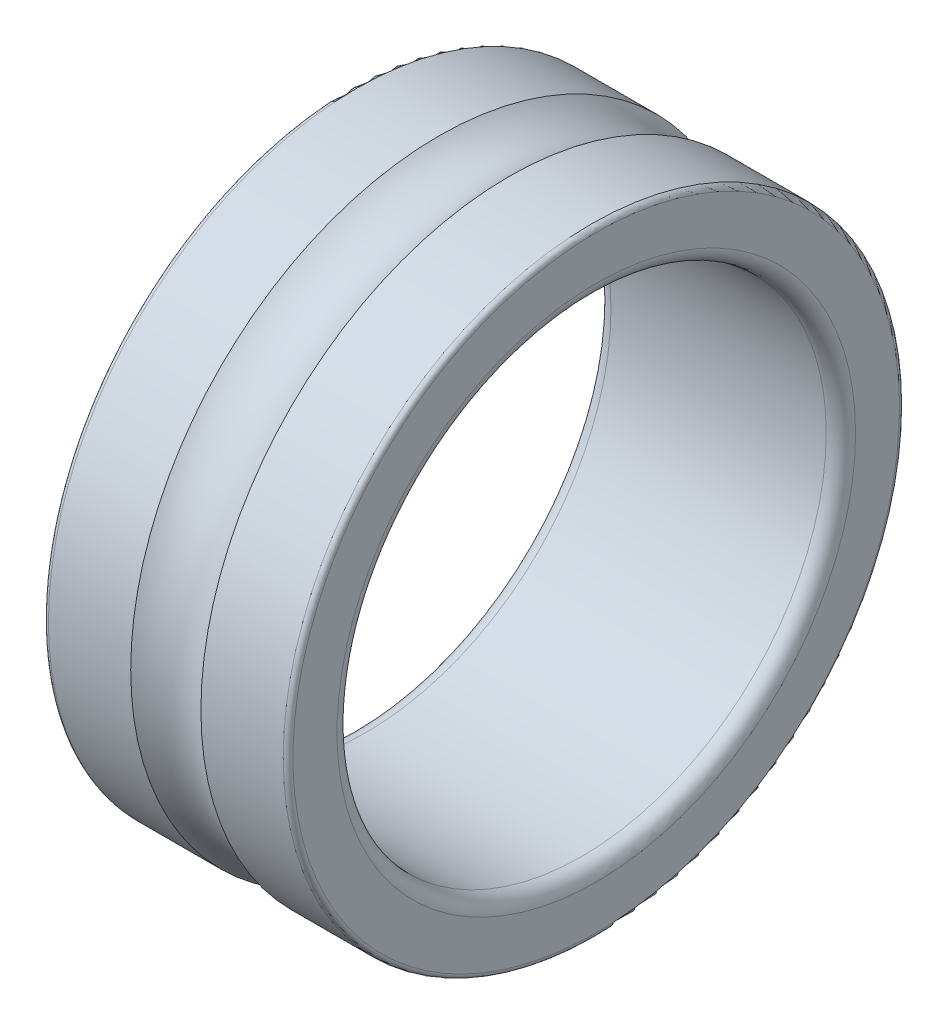
ISO-10303-21;
HEADER;
FILE_DESCRIPTION(('STEP AP214'),'2;1');
FILE_NAME('part.step','',(''),(''),'','','');
FILE_SCHEMA(('AUTOMOTIVE_DESIGN { 1 0 10303 214 1 1 1 1 }'));
ENDSEC;
DATA;
#1=APPLICATION_CONTEXT('core data for automotive mechanical design processes');
#2=APPLICATION_PROTOCOL_DEFINITION('international standard','automotive_design',2000,#1);
#3=PRODUCT_CONTEXT('',#1,'mechanical');
#4=PRODUCT('Part','Part','',(#3));
#5=PRODUCT_RELATED_PRODUCT_CATEGORY('part','',(#4));
#6=PRODUCT_DEFINITION_FORMATION('','',#4);
#7=PRODUCT_DEFINITION_CONTEXT('part definition',#1,'design');
#8=PRODUCT_DEFINITION('design','',#6,#7);
#9=PRODUCT_DEFINITION_SHAPE('','',#8);
#10=(LENGTH_UNIT() NAMED_UNIT(*) SI_UNIT(.MILLI.,.METRE.));
#11=(NAMED_UNIT(*) PLANE_ANGLE_UNIT() SI_UNIT($,.RADIAN.));
#12=(NAMED_UNIT(*) SI_UNIT($,.STERADIAN.) SOLID_ANGLE_UNIT());
#13=UNCERTAINTY_MEASURE_WITH_UNIT(LENGTH_MEASURE(1.E-05),#10,'distance_accuracy_value','');
#14=(GEOMETRIC_REPRESENTATION_CONTEXT(3) GLOBAL_UNCERTAINTY_ASSIGNED_CONTEXT((#13)) GLOBAL_UNIT_ASSIGNED_CONTEXT((#10,
#11,#12)) REPRESENTATION_CONTEXT('',''));
#15=CARTESIAN_POINT('',(0.,0.,0.));
#16=DIRECTION('',(0.,0.,1.));
#17=DIRECTION('',(1.,0.,0.));
#18=AXIS2_PLACEMENT_3D('',#15,#16,#17);
#19=CARTESIAN_POINT('',(0.,0.,0.));
#20=DIRECTION('',(1.,0.,0.));
#21=DIRECTION('',(0.,0.,-1.));
#22=AXIS2_PLACEMENT_3D('',#19,#20,#21);
#23=TOROIDAL_SURFACE('',#22,7.25,1.1905);
#24=CARTESIAN_POINT('',(-0.717488850087581,0.,0.));
#25=DIRECTION('',(-1.,0.,0.));
#26=DIRECTION('',(0.,0.,1.));
#27=AXIS2_PLACEMENT_3D('',#24,#25,#26);
#28=CIRCLE('',#27,6.3);
#29=CARTESIAN_POINT('',(-0.717488850087581,0.,6.3));
#30=VERTEX_POINT('',#29);
#31=EDGE_CURVE('E135',#30,#30,#28,.T.);
#32=ORIENTED_EDGE('',*,*,#31,.F.);
#33=EDGE_LOOP('',(#32));
#34=FACE_BOUND('',#33,.T.);
#35=CARTESIAN_POINT('',(0.717488850087582,0.,0.));
#36=DIRECTION('',(-1.,0.,0.));
#37=DIRECTION('',(0.,0.,1.));
#38=AXIS2_PLACEMENT_3D('',#35,#36,#37);
#39=CIRCLE('',#38,6.3);
#40=CARTESIAN_POINT('',(0.717488850087582,0.,6.3));
#41=VERTEX_POINT('',#40);
#42=EDGE_CURVE('E142',#41,#41,#39,.F.);
#43=ORIENTED_EDGE('',*,*,#42,.F.);
#44=EDGE_LOOP('',(#43));
#45=FACE_BOUND('',#44,.T.);
#46=ADVANCED_FACE('F14',(#34,#45),#23,.F.);
#47=CARTESIAN_POINT('',(2.2,0.,0.));
#48=DIRECTION('',(-1.,0.,0.));
#49=DIRECTION('',(0.,0.,1.));
#50=AXIS2_PLACEMENT_3D('',#47,#48,#49);
#51=CYLINDRICAL_SURFACE('',#50,6.3);
#52=CARTESIAN_POINT('',(2.4,0.,0.));
#53=DIRECTION('',(1.,0.,0.));
#54=DIRECTION('',(0.,0.,-1.));
#55=AXIS2_PLACEMENT_3D('',#52,#53,#54);
#56=CIRCLE('',#55,6.3);
#57=CARTESIAN_POINT('',(2.4,0.,-6.3));
#58=VERTEX_POINT('',#57);
#59=EDGE_CURVE('E108',#58,#58,#56,.T.);
#60=ORIENTED_EDGE('',*,*,#59,.F.);
#61=EDGE_LOOP('',(#60));
#62=FACE_BOUND('',#61,.T.);
#63=ORIENTED_EDGE('',*,*,#42,.T.);
#64=EDGE_LOOP('',(#63));
#65=FACE_BOUND('',#64,.T.);
#66=ADVANCED_FACE('F146',(#62,#65),#51,.T.);
#67=CARTESIAN_POINT('',(2.2,0.,0.));
#68=DIRECTION('',(-1.,0.,0.));
#69=DIRECTION('',(0.,0.,1.));
#70=AXIS2_PLACEMENT_3D('',#67,#68,#69);
#71=CYLINDRICAL_SURFACE('',#70,6.3);
#72=ORIENTED_EDGE('',*,*,#31,.T.);
#73=EDGE_LOOP('',(#72));
#74=FACE_BOUND('',#73,.T.);
#75=CARTESIAN_POINT('',(-2.4,0.,0.));
#76=DIRECTION('',(1.,0.,0.));
#77=DIRECTION('',(0.,0.,-1.));
#78=AXIS2_PLACEMENT_3D('',#75,#76,#77);
#79=CIRCLE('',#78,6.3);
#80=CARTESIAN_POINT('',(-2.4,0.,-6.3));
#81=VERTEX_POINT('',#80);
#82=EDGE_CURVE('E105',#81,#81,#79,.F.);
#83=ORIENTED_EDGE('',*,*,#82,.F.);
#84=EDGE_LOOP('',(#83));
#85=FACE_BOUND('',#84,.T.);
#86=ADVANCED_FACE('F129',(#74,#85),#71,.T.);
#87=CARTESIAN_POINT('',(2.4,0.,0.));
#88=DIRECTION('',(1.,0.,0.));
#89=DIRECTION('',(0.,0.,-1.));
#90=AXIS2_PLACEMENT_3D('',#87,#88,#89);
#91=TOROIDAL_SURFACE('',#90,6.2,0.1);
#92=CARTESIAN_POINT('',(2.5,0.,0.));
#93=DIRECTION('',(-1.,0.,0.));
#94=DIRECTION('',(0.,0.,-1.));
#95=AXIS2_PLACEMENT_3D('',#92,#93,#94);
#96=CIRCLE('',#95,6.2);
#97=CARTESIAN_POINT('',(2.5,0.,-6.2));
#98=VERTEX_POINT('',#97);
#99=EDGE_CURVE('E60',#98,#98,#96,.F.);
#100=ORIENTED_EDGE('',*,*,#99,.F.);
#101=EDGE_LOOP('',(#100));
#102=FACE_BOUND('',#101,.T.);
#103=ORIENTED_EDGE('',*,*,#59,.T.);
#104=EDGE_LOOP('',(#103));
#105=FACE_BOUND('',#104,.T.);
#106=ADVANCED_FACE('F125',(#102,#105),#91,.T.);
#107=CARTESIAN_POINT('',(-2.4,0.,0.));
#108=DIRECTION('',(1.,0.,0.));
#109=DIRECTION('',(0.,0.,-1.));
#110=AXIS2_PLACEMENT_3D('',#107,#108,#109);
#111=TOROIDAL_SURFACE('',#110,6.2,0.100000000000001);
#112=ORIENTED_EDGE('',*,*,#82,.T.);
#113=EDGE_LOOP('',(#112));
#114=FACE_BOUND('',#113,.T.);
#115=CARTESIAN_POINT('',(-2.5,0.,0.));
#116=DIRECTION('',(1.,0.,0.));
#117=DIRECTION('',(0.,0.,-1.));
#118=AXIS2_PLACEMENT_3D('',#115,#116,#117);
#119=CIRCLE('',#118,6.2);
#120=CARTESIAN_POINT('',(-2.5,0.,-6.2));
#121=VERTEX_POINT('',#120);
#122=EDGE_CURVE('E113',#121,#121,#119,.F.);
#123=ORIENTED_EDGE('',*,*,#122,.F.);
#124=EDGE_LOOP('',(#123));
#125=FACE_BOUND('',#124,.T.);
#126=ADVANCED_FACE('F77',(#114,#125),#111,.T.);
#127=CARTESIAN_POINT('',(2.5,5.3,0.));
#128=DIRECTION('',(1.,0.,0.));
#129=DIRECTION('',(0.,0.,-1.));
#130=AXIS2_PLACEMENT_3D('',#127,#128,#129);
#131=PLANE('',#130);
#132=CARTESIAN_POINT('',(2.5,0.,0.));
#133=DIRECTION('',(1.,0.,0.));
#134=DIRECTION('',(0.,0.,-1.));
#135=AXIS2_PLACEMENT_3D('',#132,#133,#134);
#136=CIRCLE('',#135,5.3);
#137=CARTESIAN_POINT('',(2.5,0.,-5.3));
#138=VERTEX_POINT('',#137);
#139=EDGE_CURVE('E95',#138,#138,#136,.T.);
#140=ORIENTED_EDGE('',*,*,#139,.F.);
#141=EDGE_LOOP('',(#140));
#142=FACE_BOUND('',#141,.T.);
#143=ORIENTED_EDGE('',*,*,#99,.T.);
#144=EDGE_LOOP('',(#143));
#145=FACE_BOUND('',#144,.T.);
#146=ADVANCED_FACE('F67',(#142,#145),#131,.T.);
#147=CARTESIAN_POINT('',(-2.5,6.2,0.));
#148=DIRECTION('',(-1.,0.,0.));
#149=DIRECTION('',(0.,0.,1.));
#150=AXIS2_PLACEMENT_3D('',#147,#148,#149);
#151=PLANE('',#150);
#152=ORIENTED_EDGE('',*,*,#122,.T.);
#153=EDGE_LOOP('',(#152));
#154=FACE_BOUND('',#153,.T.);
#155=CARTESIAN_POINT('',(-2.5,0.,0.));
#156=DIRECTION('',(-1.,0.,0.));
#157=DIRECTION('',(0.,0.,-1.));
#158=AXIS2_PLACEMENT_3D('',#155,#156,#157);
#159=CIRCLE('',#158,5.3);
#160=CARTESIAN_POINT('',(-2.5,0.,-5.3));
#161=VERTEX_POINT('',#160);
#162=EDGE_CURVE('E26',#161,#161,#159,.T.);
#163=ORIENTED_EDGE('',*,*,#162,.F.);
#164=EDGE_LOOP('',(#163));
#165=FACE_BOUND('',#164,.T.);
#166=ADVANCED_FACE('F76',(#154,#165),#151,.T.);
#167=CARTESIAN_POINT('',(2.2,0.,0.));
#168=DIRECTION('',(1.,0.,0.));
#169=DIRECTION('',(0.,0.,-1.));
#170=AXIS2_PLACEMENT_3D('',#167,#168,#169);
#171=TOROIDAL_SURFACE('',#170,5.3,0.300000000000003);
#172=CARTESIAN_POINT('',(2.2,0.,0.));
#173=DIRECTION('',(-1.,0.,0.));
#174=DIRECTION('',(0.,0.,1.));
#175=AXIS2_PLACEMENT_3D('',#172,#173,#174);
#176=CIRCLE('',#175,5.);
#177=CARTESIAN_POINT('',(2.2,0.,5.));
#178=VERTEX_POINT('',#177);
#179=EDGE_CURVE('E21',#178,#178,#176,.T.);
#180=ORIENTED_EDGE('',*,*,#179,.T.);
#181=EDGE_LOOP('',(#180));
#182=FACE_BOUND('',#181,.T.);
#183=ORIENTED_EDGE('',*,*,#139,.T.);
#184=EDGE_LOOP('',(#183));
#185=FACE_BOUND('',#184,.T.);
#186=ADVANCED_FACE('F40',(#182,#185),#171,.T.);
#187=CARTESIAN_POINT('',(-2.2,0.,0.));
#188=DIRECTION('',(1.,0.,0.));
#189=DIRECTION('',(0.,0.,-1.));
#190=AXIS2_PLACEMENT_3D('',#187,#188,#189);
#191=TOROIDAL_SURFACE('',#190,5.3,0.300000000000002);
#192=ORIENTED_EDGE('',*,*,#162,.T.);
#193=EDGE_LOOP('',(#192));
#194=FACE_BOUND('',#193,.T.);
#195=CARTESIAN_POINT('',(-2.2,0.,0.));
#196=DIRECTION('',(-1.,0.,0.));
#197=DIRECTION('',(0.,0.,1.));
#198=AXIS2_PLACEMENT_3D('',#195,#196,#197);
#199=CIRCLE('',#198,5.);
#200=CARTESIAN_POINT('',(-2.2,0.,5.));
#201=VERTEX_POINT('',#200);
#202=EDGE_CURVE('E9',#201,#201,#199,.F.);
#203=ORIENTED_EDGE('',*,*,#202,.T.);
#204=EDGE_LOOP('',(#203));
#205=FACE_BOUND('',#204,.T.);
#206=ADVANCED_FACE('F34',(#194,#205),#191,.T.);
#207=CARTESIAN_POINT('',(2.2,0.,0.));
#208=DIRECTION('',(-1.,0.,0.));
#209=DIRECTION('',(0.,0.,1.));
#210=AXIS2_PLACEMENT_3D('',#207,#208,#209);
#211=CYLINDRICAL_SURFACE('',#210,5.);
#212=ORIENTED_EDGE('',*,*,#202,.F.);
#213=EDGE_LOOP('',(#212));
#214=FACE_BOUND('',#213,.T.);
#215=ORIENTED_EDGE('',*,*,#179,.F.);
#216=EDGE_LOOP('',(#215));
#217=FACE_BOUND('',#216,.T.);
#218=ADVANCED_FACE('F39',(#214,#217),#211,.F.);
#219=CLOSED_SHELL('',(#46,#66,#86,#106,#126,#146,#166,#186,#206,#218));
#220=MANIFOLD_SOLID_BREP('B1',#219);
#221=ADVANCED_BREP_SHAPE_REPRESENTATION('',(#18,#220),#14);
#222=SHAPE_DEFINITION_REPRESENTATION(#9,#221);
ENDSEC;
END-ISO-10303-21;
